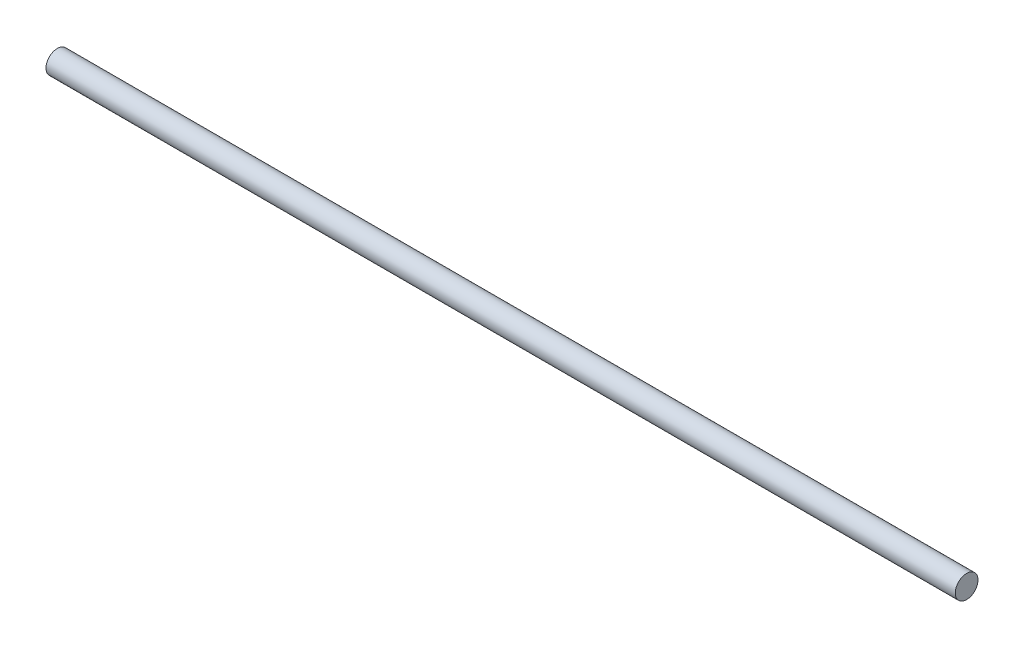
ISO-10303-21;
HEADER;
FILE_DESCRIPTION(('STEP AP214'),'2;1');
FILE_NAME('part.step','',(''),(''),'','','');
FILE_SCHEMA(('AUTOMOTIVE_DESIGN { 1 0 10303 214 1 1 1 1 }'));
ENDSEC;
DATA;
#1=APPLICATION_CONTEXT('core data for automotive mechanical design processes');
#2=APPLICATION_PROTOCOL_DEFINITION('international standard','automotive_design',2000,#1);
#3=PRODUCT_CONTEXT('',#1,'mechanical');
#4=PRODUCT('Part','Part','',(#3));
#5=PRODUCT_RELATED_PRODUCT_CATEGORY('part','',(#4));
#6=PRODUCT_DEFINITION_FORMATION('','',#4);
#7=PRODUCT_DEFINITION_CONTEXT('part definition',#1,'design');
#8=PRODUCT_DEFINITION('design','',#6,#7);
#9=PRODUCT_DEFINITION_SHAPE('','',#8);
#10=(LENGTH_UNIT() NAMED_UNIT(*) SI_UNIT(.MILLI.,.METRE.));
#11=(NAMED_UNIT(*) PLANE_ANGLE_UNIT() SI_UNIT($,.RADIAN.));
#12=(NAMED_UNIT(*) SI_UNIT($,.STERADIAN.) SOLID_ANGLE_UNIT());
#13=UNCERTAINTY_MEASURE_WITH_UNIT(LENGTH_MEASURE(1.E-05),#10,'distance_accuracy_value','');
#14=(GEOMETRIC_REPRESENTATION_CONTEXT(3) GLOBAL_UNCERTAINTY_ASSIGNED_CONTEXT((#13)) GLOBAL_UNIT_ASSIGNED_CONTEXT((#10,
#11,#12)) REPRESENTATION_CONTEXT('',''));
#15=CARTESIAN_POINT('',(0.,0.,0.));
#16=DIRECTION('',(0.,0.,1.));
#17=DIRECTION('',(1.,0.,0.));
#18=AXIS2_PLACEMENT_3D('',#15,#16,#17);
#19=CARTESIAN_POINT('',(100.,0.,0.));
#20=DIRECTION('',(-1.,0.,0.));
#21=DIRECTION('',(0.,0.,1.));
#22=AXIS2_PLACEMENT_3D('',#19,#20,#21);
#23=CYLINDRICAL_SURFACE('',#22,1.25);
#24=CARTESIAN_POINT('',(100.,0.,0.));
#25=DIRECTION('',(1.,0.,0.));
#26=DIRECTION('',(0.,0.,-1.));
#27=AXIS2_PLACEMENT_3D('',#24,#25,#26);
#28=CIRCLE('',#27,1.25);
#29=CARTESIAN_POINT('',(100.,0.,-1.25));
#30=VERTEX_POINT('',#29);
#31=EDGE_CURVE('E10',#30,#30,#28,.T.);
#32=ORIENTED_EDGE('',*,*,#31,.F.);
#33=EDGE_LOOP('',(#32));
#34=FACE_BOUND('',#33,.T.);
#35=CARTESIAN_POINT('',(0.,0.,0.));
#36=DIRECTION('',(1.,0.,0.));
#37=DIRECTION('',(0.,0.,-1.));
#38=AXIS2_PLACEMENT_3D('',#35,#36,#37);
#39=CIRCLE('',#38,1.25);
#40=CARTESIAN_POINT('',(0.,0.,-1.25));
#41=VERTEX_POINT('',#40);
#42=EDGE_CURVE('E33',#41,#41,#39,.T.);
#43=ORIENTED_EDGE('',*,*,#42,.T.);
#44=EDGE_LOOP('',(#43));
#45=FACE_BOUND('',#44,.T.);
#46=ADVANCED_FACE('F30',(#34,#45),#23,.T.);
#47=CARTESIAN_POINT('',(100.,0.,0.));
#48=DIRECTION('',(1.,0.,0.));
#49=DIRECTION('',(0.,0.,-1.));
#50=AXIS2_PLACEMENT_3D('',#47,#48,#49);
#51=PLANE('',#50);
#52=ORIENTED_EDGE('',*,*,#31,.T.);
#53=EDGE_LOOP('',(#52));
#54=FACE_BOUND('',#53,.T.);
#55=ADVANCED_FACE('F45',(#54),#51,.T.);
#56=CARTESIAN_POINT('',(0.,0.,0.));
#57=DIRECTION('',(1.,0.,0.));
#58=DIRECTION('',(0.,0.,-1.));
#59=AXIS2_PLACEMENT_3D('',#56,#57,#58);
#60=PLANE('',#59);
#61=ORIENTED_EDGE('',*,*,#42,.F.);
#62=EDGE_LOOP('',(#61));
#63=FACE_BOUND('',#62,.T.);
#64=ADVANCED_FACE('F43',(#63),#60,.F.);
#65=CLOSED_SHELL('',(#46,#55,#64));
#66=MANIFOLD_SOLID_BREP('B2',#65);
#67=ADVANCED_BREP_SHAPE_REPRESENTATION('',(#18,#66),#14);
#68=SHAPE_DEFINITION_REPRESENTATION(#9,#67);
ENDSEC;
END-ISO-10303-21;
